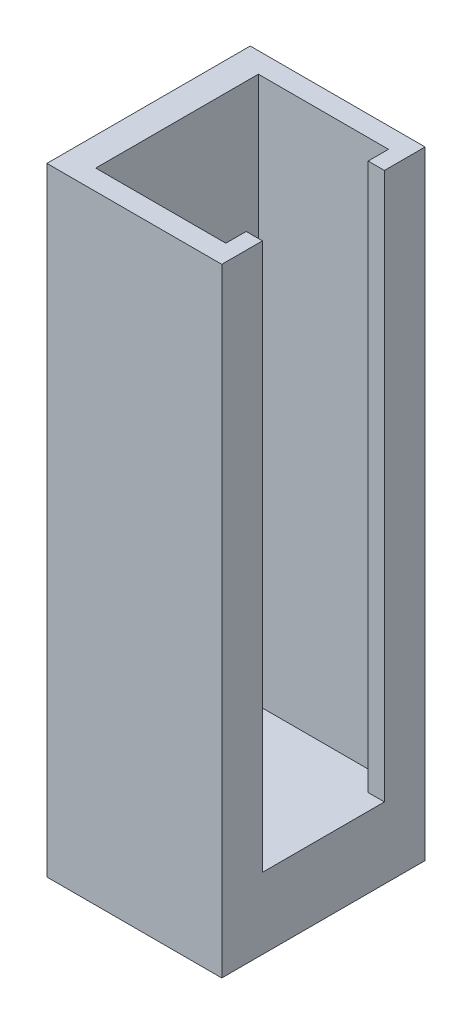
ISO-10303-21;
HEADER;
FILE_DESCRIPTION(('STEP AP214'),'2;1');
FILE_NAME('part.step','',(''),(''),'','','');
FILE_SCHEMA(('AUTOMOTIVE_DESIGN { 1 0 10303 214 1 1 1 1 }'));
ENDSEC;
DATA;
#1=APPLICATION_CONTEXT('core data for automotive mechanical design processes');
#2=APPLICATION_PROTOCOL_DEFINITION('international standard','automotive_design',2000,#1);
#3=PRODUCT_CONTEXT('',#1,'mechanical');
#4=PRODUCT('Part','Part','',(#3));
#5=PRODUCT_RELATED_PRODUCT_CATEGORY('part','',(#4));
#6=PRODUCT_DEFINITION_FORMATION('','',#4);
#7=PRODUCT_DEFINITION_CONTEXT('part definition',#1,'design');
#8=PRODUCT_DEFINITION('design','',#6,#7);
#9=PRODUCT_DEFINITION_SHAPE('','',#8);
#10=(LENGTH_UNIT() NAMED_UNIT(*) SI_UNIT(.MILLI.,.METRE.));
#11=(NAMED_UNIT(*) PLANE_ANGLE_UNIT() SI_UNIT($,.RADIAN.));
#12=(NAMED_UNIT(*) SI_UNIT($,.STERADIAN.) SOLID_ANGLE_UNIT());
#13=UNCERTAINTY_MEASURE_WITH_UNIT(LENGTH_MEASURE(1.E-05),#10,'distance_accuracy_value','');
#14=(GEOMETRIC_REPRESENTATION_CONTEXT(3) GLOBAL_UNCERTAINTY_ASSIGNED_CONTEXT((#13)) GLOBAL_UNIT_ASSIGNED_CONTEXT((#10,
#11,#12)) REPRESENTATION_CONTEXT('',''));
#15=CARTESIAN_POINT('',(0.,0.,0.));
#16=DIRECTION('',(0.,0.,1.));
#17=DIRECTION('',(1.,0.,0.));
#18=AXIS2_PLACEMENT_3D('',#15,#16,#17);
#19=CARTESIAN_POINT('',(-2.15,0.,2.5));
#20=DIRECTION('',(1.,0.,0.));
#21=DIRECTION('',(0.,0.,-1.));
#22=AXIS2_PLACEMENT_3D('',#19,#20,#21);
#23=PLANE('',#22);
#24=DIRECTION('',(0.,-1.,0.));
#25=VECTOR('',#24,1.);
#26=CARTESIAN_POINT('',(-2.15,0.,-2.5));
#27=LINE('',#26,#25);
#28=CARTESIAN_POINT('',(-2.15,15.2,-2.5));
#29=VERTEX_POINT('',#28);
#30=CARTESIAN_POINT('',(-2.15,0.,-2.5));
#31=VERTEX_POINT('',#30);
#32=EDGE_CURVE('E165',#29,#31,#27,.T.);
#33=ORIENTED_EDGE('',*,*,#32,.T.);
#34=DIRECTION('',(0.,0.,-1.));
#35=VECTOR('',#34,1.);
#36=CARTESIAN_POINT('',(-2.15,0.,2.5));
#37=LINE('',#36,#35);
#38=CARTESIAN_POINT('',(-2.15,0.,2.5));
#39=VERTEX_POINT('',#38);
#40=EDGE_CURVE('E11',#39,#31,#37,.T.);
#41=ORIENTED_EDGE('',*,*,#40,.F.);
#42=DIRECTION('',(0.,-1.,0.));
#43=VECTOR('',#42,1.);
#44=CARTESIAN_POINT('',(-2.15,0.,2.5));
#45=LINE('',#44,#43);
#46=CARTESIAN_POINT('',(-2.15,15.2,2.5));
#47=VERTEX_POINT('',#46);
#48=EDGE_CURVE('E159',#47,#39,#45,.T.);
#49=ORIENTED_EDGE('',*,*,#48,.F.);
#50=DIRECTION('',(0.,0.,-1.));
#51=VECTOR('',#50,1.);
#52=CARTESIAN_POINT('',(-2.15,15.2,2.5));
#53=LINE('',#52,#51);
#54=EDGE_CURVE('E155',#47,#29,#53,.T.);
#55=ORIENTED_EDGE('',*,*,#54,.T.);
#56=EDGE_LOOP('',(#33,#41,#49,#55));
#57=FACE_BOUND('',#56,.T.);
#58=ADVANCED_FACE('F34',(#57),#23,.F.);
#59=CARTESIAN_POINT('',(-2.15,0.,2.5));
#60=DIRECTION('',(0.,1.,0.));
#61=DIRECTION('',(-1.,0.,0.));
#62=AXIS2_PLACEMENT_3D('',#59,#60,#61);
#63=PLANE('',#62);
#64=DIRECTION('',(1.,0.,0.));
#65=VECTOR('',#64,1.);
#66=CARTESIAN_POINT('',(-2.15,0.,-2.5));
#67=LINE('',#66,#65);
#68=CARTESIAN_POINT('',(2.15,0.,-2.5));
#69=VERTEX_POINT('',#68);
#70=EDGE_CURVE('E163',#31,#69,#67,.T.);
#71=ORIENTED_EDGE('',*,*,#70,.T.);
#72=DIRECTION('',(0.,0.,-1.));
#73=VECTOR('',#72,1.);
#74=CARTESIAN_POINT('',(2.15,0.,2.5));
#75=LINE('',#74,#73);
#76=CARTESIAN_POINT('',(2.15,0.,2.5));
#77=VERTEX_POINT('',#76);
#78=EDGE_CURVE('E41',#77,#69,#75,.T.);
#79=ORIENTED_EDGE('',*,*,#78,.F.);
#80=DIRECTION('',(1.,0.,0.));
#81=VECTOR('',#80,1.);
#82=CARTESIAN_POINT('',(-2.15,0.,2.5));
#83=LINE('',#82,#81);
#84=EDGE_CURVE('E84',#39,#77,#83,.T.);
#85=ORIENTED_EDGE('',*,*,#84,.F.);
#86=ORIENTED_EDGE('',*,*,#40,.T.);
#87=EDGE_LOOP('',(#71,#79,#85,#86));
#88=FACE_BOUND('',#87,.T.);
#89=ADVANCED_FACE('F247',(#88),#63,.F.);
#90=CARTESIAN_POINT('',(2.15,0.,2.5));
#91=DIRECTION('',(-1.,0.,0.));
#92=DIRECTION('',(0.,0.,1.));
#93=AXIS2_PLACEMENT_3D('',#90,#91,#92);
#94=PLANE('',#93);
#95=DIRECTION('',(0.,0.,-1.));
#96=VECTOR('',#95,1.);
#97=CARTESIAN_POINT('',(2.15,15.2,2.5));
#98=LINE('',#97,#96);
#99=CARTESIAN_POINT('',(2.15,15.2,-1.5));
#100=VERTEX_POINT('',#99);
#101=CARTESIAN_POINT('',(2.15,15.2,-2.5));
#102=VERTEX_POINT('',#101);
#103=EDGE_CURVE('E152',#100,#102,#98,.T.);
#104=ORIENTED_EDGE('',*,*,#103,.F.);
#105=DIRECTION('',(0.,-1.,0.));
#106=VECTOR('',#105,1.);
#107=CARTESIAN_POINT('',(2.15,15.2,-1.5));
#108=LINE('',#107,#106);
#109=CARTESIAN_POINT('',(2.15,1.75,-1.5));
#110=VERTEX_POINT('',#109);
#111=EDGE_CURVE('E168',#100,#110,#108,.T.);
#112=ORIENTED_EDGE('',*,*,#111,.T.);
#113=DIRECTION('',(0.,0.,1.));
#114=VECTOR('',#113,1.);
#115=CARTESIAN_POINT('',(2.15,1.75,-1.5));
#116=LINE('',#115,#114);
#117=CARTESIAN_POINT('',(2.15,1.75,1.5));
#118=VERTEX_POINT('',#117);
#119=EDGE_CURVE('E147',#110,#118,#116,.T.);
#120=ORIENTED_EDGE('',*,*,#119,.T.);
#121=DIRECTION('',(0.,-1.,0.));
#122=VECTOR('',#121,1.);
#123=CARTESIAN_POINT('',(2.15,15.2,1.5));
#124=LINE('',#123,#122);
#125=CARTESIAN_POINT('',(2.15,15.2,1.5));
#126=VERTEX_POINT('',#125);
#127=EDGE_CURVE('E133',#126,#118,#124,.T.);
#128=ORIENTED_EDGE('',*,*,#127,.F.);
#129=CARTESIAN_POINT('',(2.15,15.2,2.5));
#130=VERTEX_POINT('',#129);
#131=EDGE_CURVE('E145',#130,#126,#98,.T.);
#132=ORIENTED_EDGE('',*,*,#131,.F.);
#133=DIRECTION('',(0.,1.,0.));
#134=VECTOR('',#133,1.);
#135=CARTESIAN_POINT('',(2.15,0.,2.5));
#136=LINE('',#135,#134);
#137=EDGE_CURVE('E170',#77,#130,#136,.T.);
#138=ORIENTED_EDGE('',*,*,#137,.F.);
#139=ORIENTED_EDGE('',*,*,#78,.T.);
#140=DIRECTION('',(0.,1.,0.));
#141=VECTOR('',#140,1.);
#142=CARTESIAN_POINT('',(2.15,0.,-2.5));
#143=LINE('',#142,#141);
#144=EDGE_CURVE('E160',#69,#102,#143,.T.);
#145=ORIENTED_EDGE('',*,*,#144,.T.);
#146=EDGE_LOOP('',(#104,#112,#120,#128,#132,#138,#139,#145));
#147=FACE_BOUND('',#146,.T.);
#148=ADVANCED_FACE('F143',(#147),#94,.F.);
#149=CARTESIAN_POINT('',(-2.15,15.2,2.5));
#150=DIRECTION('',(0.,-1.,0.));
#151=DIRECTION('',(0.,0.,-1.));
#152=AXIS2_PLACEMENT_3D('',#149,#150,#151);
#153=PLANE('',#152);
#154=DIRECTION('',(0.,0.,1.));
#155=VECTOR('',#154,1.);
#156=CARTESIAN_POINT('',(1.75,15.2,-2.));
#157=LINE('',#156,#155);
#158=CARTESIAN_POINT('',(1.75,15.2,-2.));
#159=VERTEX_POINT('',#158);
#160=CARTESIAN_POINT('',(1.75,15.2,-1.5));
#161=VERTEX_POINT('',#160);
#162=EDGE_CURVE('E208',#159,#161,#157,.T.);
#163=ORIENTED_EDGE('',*,*,#162,.T.);
#164=DIRECTION('',(1.,0.,0.));
#165=VECTOR('',#164,1.);
#166=CARTESIAN_POINT('',(1.75,15.2,-1.5));
#167=LINE('',#166,#165);
#168=EDGE_CURVE('E148',#161,#100,#167,.T.);
#169=ORIENTED_EDGE('',*,*,#168,.T.);
#170=ORIENTED_EDGE('',*,*,#103,.T.);
#171=DIRECTION('',(-1.,0.,0.));
#172=VECTOR('',#171,1.);
#173=CARTESIAN_POINT('',(-2.15,15.2,-2.5));
#174=LINE('',#173,#172);
#175=EDGE_CURVE('E77',#102,#29,#174,.T.);
#176=ORIENTED_EDGE('',*,*,#175,.T.);
#177=ORIENTED_EDGE('',*,*,#54,.F.);
#178=DIRECTION('',(-1.,0.,0.));
#179=VECTOR('',#178,1.);
#180=CARTESIAN_POINT('',(-2.15,15.2,2.5));
#181=LINE('',#180,#179);
#182=EDGE_CURVE('E57',#130,#47,#181,.T.);
#183=ORIENTED_EDGE('',*,*,#182,.F.);
#184=ORIENTED_EDGE('',*,*,#131,.T.);
#185=DIRECTION('',(-1.,0.,0.));
#186=VECTOR('',#185,1.);
#187=CARTESIAN_POINT('',(2.15,15.2,1.5));
#188=LINE('',#187,#186);
#189=CARTESIAN_POINT('',(1.75,15.2,1.5));
#190=VERTEX_POINT('',#189);
#191=EDGE_CURVE('E129',#126,#190,#188,.T.);
#192=ORIENTED_EDGE('',*,*,#191,.T.);
#193=DIRECTION('',(0.,0.,1.));
#194=VECTOR('',#193,1.);
#195=CARTESIAN_POINT('',(1.75,15.2,1.5));
#196=LINE('',#195,#194);
#197=CARTESIAN_POINT('',(1.75,15.2,2.));
#198=VERTEX_POINT('',#197);
#199=EDGE_CURVE('E48',#190,#198,#196,.T.);
#200=ORIENTED_EDGE('',*,*,#199,.T.);
#201=DIRECTION('',(-1.,0.,0.));
#202=VECTOR('',#201,1.);
#203=CARTESIAN_POINT('',(1.75,15.2,2.));
#204=LINE('',#203,#202);
#205=CARTESIAN_POINT('',(-1.45,15.2,2.));
#206=VERTEX_POINT('',#205);
#207=EDGE_CURVE('E216',#198,#206,#204,.T.);
#208=ORIENTED_EDGE('',*,*,#207,.T.);
#209=DIRECTION('',(0.,0.,-1.));
#210=VECTOR('',#209,1.);
#211=CARTESIAN_POINT('',(-1.45,15.2,2.));
#212=LINE('',#211,#210);
#213=CARTESIAN_POINT('',(-1.45,15.2,-2.));
#214=VERTEX_POINT('',#213);
#215=EDGE_CURVE('E213',#206,#214,#212,.T.);
#216=ORIENTED_EDGE('',*,*,#215,.T.);
#217=DIRECTION('',(1.,0.,0.));
#218=VECTOR('',#217,1.);
#219=CARTESIAN_POINT('',(-1.45,15.2,-2.));
#220=LINE('',#219,#218);
#221=EDGE_CURVE('E210',#214,#159,#220,.T.);
#222=ORIENTED_EDGE('',*,*,#221,.T.);
#223=EDGE_LOOP('',(#163,#169,#170,#176,#177,#183,#184,#192,#200,#208,#216,#222));
#224=FACE_BOUND('',#223,.T.);
#225=ADVANCED_FACE('F151',(#224),#153,.F.);
#226=CARTESIAN_POINT('',(0.,0.,2.5));
#227=DIRECTION('',(0.,0.,-1.));
#228=DIRECTION('',(-1.,0.,0.));
#229=AXIS2_PLACEMENT_3D('',#226,#227,#228);
#230=PLANE('',#229);
#231=ORIENTED_EDGE('',*,*,#48,.T.);
#232=ORIENTED_EDGE('',*,*,#84,.T.);
#233=ORIENTED_EDGE('',*,*,#137,.T.);
#234=ORIENTED_EDGE('',*,*,#182,.T.);
#235=EDGE_LOOP('',(#231,#232,#233,#234));
#236=FACE_BOUND('',#235,.T.);
#237=ADVANCED_FACE('F246',(#236),#230,.F.);
#238=CARTESIAN_POINT('',(0.,0.,-2.5));
#239=DIRECTION('',(0.,0.,-1.));
#240=DIRECTION('',(-1.,0.,0.));
#241=AXIS2_PLACEMENT_3D('',#238,#239,#240);
#242=PLANE('',#241);
#243=ORIENTED_EDGE('',*,*,#32,.F.);
#244=ORIENTED_EDGE('',*,*,#175,.F.);
#245=ORIENTED_EDGE('',*,*,#144,.F.);
#246=ORIENTED_EDGE('',*,*,#70,.F.);
#247=EDGE_LOOP('',(#243,#244,#245,#246));
#248=FACE_BOUND('',#247,.T.);
#249=ADVANCED_FACE('F242',(#248),#242,.T.);
#250=CARTESIAN_POINT('',(1.75,15.2,-1.5));
#251=DIRECTION('',(0.,0.,-1.));
#252=DIRECTION('',(-1.,0.,0.));
#253=AXIS2_PLACEMENT_3D('',#250,#251,#252);
#254=PLANE('',#253);
#255=DIRECTION('',(1.,0.,0.));
#256=VECTOR('',#255,1.);
#257=CARTESIAN_POINT('',(1.75,1.75,-1.5));
#258=LINE('',#257,#256);
#259=CARTESIAN_POINT('',(1.75,1.75,-1.5));
#260=VERTEX_POINT('',#259);
#261=EDGE_CURVE('E137',#260,#110,#258,.T.);
#262=ORIENTED_EDGE('',*,*,#261,.T.);
#263=ORIENTED_EDGE('',*,*,#111,.F.);
#264=ORIENTED_EDGE('',*,*,#168,.F.);
#265=DIRECTION('',(0.,-1.,0.));
#266=VECTOR('',#265,1.);
#267=CARTESIAN_POINT('',(1.75,15.2,-1.5));
#268=LINE('',#267,#266);
#269=EDGE_CURVE('E183',#161,#260,#268,.T.);
#270=ORIENTED_EDGE('',*,*,#269,.T.);
#271=EDGE_LOOP('',(#262,#263,#264,#270));
#272=FACE_BOUND('',#271,.T.);
#273=ADVANCED_FACE('F238',(#272),#254,.F.);
#274=CARTESIAN_POINT('',(1.75,15.2,-2.));
#275=DIRECTION('',(1.,0.,0.));
#276=DIRECTION('',(0.,0.,-1.));
#277=AXIS2_PLACEMENT_3D('',#274,#275,#276);
#278=PLANE('',#277);
#279=DIRECTION('',(0.,0.,1.));
#280=VECTOR('',#279,1.);
#281=CARTESIAN_POINT('',(1.75,1.75,-2.));
#282=LINE('',#281,#280);
#283=CARTESIAN_POINT('',(1.75,1.75,-2.));
#284=VERTEX_POINT('',#283);
#285=EDGE_CURVE('E188',#284,#260,#282,.T.);
#286=ORIENTED_EDGE('',*,*,#285,.T.);
#287=ORIENTED_EDGE('',*,*,#269,.F.);
#288=ORIENTED_EDGE('',*,*,#162,.F.);
#289=DIRECTION('',(0.,-1.,0.));
#290=VECTOR('',#289,1.);
#291=CARTESIAN_POINT('',(1.75,15.2,-2.));
#292=LINE('',#291,#290);
#293=EDGE_CURVE('E181',#159,#284,#292,.T.);
#294=ORIENTED_EDGE('',*,*,#293,.T.);
#295=EDGE_LOOP('',(#286,#287,#288,#294));
#296=FACE_BOUND('',#295,.T.);
#297=ADVANCED_FACE('F234',(#296),#278,.F.);
#298=CARTESIAN_POINT('',(-1.45,15.2,-2.));
#299=DIRECTION('',(0.,0.,-1.));
#300=DIRECTION('',(-1.,0.,0.));
#301=AXIS2_PLACEMENT_3D('',#298,#299,#300);
#302=PLANE('',#301);
#303=DIRECTION('',(1.,0.,0.));
#304=VECTOR('',#303,1.);
#305=CARTESIAN_POINT('',(-1.45,1.75,-2.));
#306=LINE('',#305,#304);
#307=CARTESIAN_POINT('',(-1.45,1.75,-2.));
#308=VERTEX_POINT('',#307);
#309=EDGE_CURVE('E191',#308,#284,#306,.T.);
#310=ORIENTED_EDGE('',*,*,#309,.T.);
#311=ORIENTED_EDGE('',*,*,#293,.F.);
#312=ORIENTED_EDGE('',*,*,#221,.F.);
#313=DIRECTION('',(0.,-1.,0.));
#314=VECTOR('',#313,1.);
#315=CARTESIAN_POINT('',(-1.45,15.2,-2.));
#316=LINE('',#315,#314);
#317=EDGE_CURVE('E179',#214,#308,#316,.T.);
#318=ORIENTED_EDGE('',*,*,#317,.T.);
#319=EDGE_LOOP('',(#310,#311,#312,#318));
#320=FACE_BOUND('',#319,.T.);
#321=ADVANCED_FACE('F230',(#320),#302,.F.);
#322=CARTESIAN_POINT('',(-1.45,15.2,2.));
#323=DIRECTION('',(-1.,0.,0.));
#324=DIRECTION('',(0.,-1.,0.));
#325=AXIS2_PLACEMENT_3D('',#322,#323,#324);
#326=PLANE('',#325);
#327=DIRECTION('',(0.,0.,-1.));
#328=VECTOR('',#327,1.);
#329=CARTESIAN_POINT('',(-1.45,1.75,2.));
#330=LINE('',#329,#328);
#331=CARTESIAN_POINT('',(-1.45,1.75,2.));
#332=VERTEX_POINT('',#331);
#333=EDGE_CURVE('E194',#332,#308,#330,.T.);
#334=ORIENTED_EDGE('',*,*,#333,.T.);
#335=ORIENTED_EDGE('',*,*,#317,.F.);
#336=ORIENTED_EDGE('',*,*,#215,.F.);
#337=DIRECTION('',(0.,-1.,0.));
#338=VECTOR('',#337,1.);
#339=CARTESIAN_POINT('',(-1.45,15.2,2.));
#340=LINE('',#339,#338);
#341=EDGE_CURVE('E177',#206,#332,#340,.T.);
#342=ORIENTED_EDGE('',*,*,#341,.T.);
#343=EDGE_LOOP('',(#334,#335,#336,#342));
#344=FACE_BOUND('',#343,.T.);
#345=ADVANCED_FACE('F226',(#344),#326,.F.);
#346=CARTESIAN_POINT('',(1.75,15.2,2.));
#347=DIRECTION('',(0.,0.,1.));
#348=DIRECTION('',(1.,0.,0.));
#349=AXIS2_PLACEMENT_3D('',#346,#347,#348);
#350=PLANE('',#349);
#351=DIRECTION('',(-1.,0.,0.));
#352=VECTOR('',#351,1.);
#353=CARTESIAN_POINT('',(1.75,1.75,2.));
#354=LINE('',#353,#352);
#355=CARTESIAN_POINT('',(1.75,1.75,2.));
#356=VERTEX_POINT('',#355);
#357=EDGE_CURVE('E197',#356,#332,#354,.T.);
#358=ORIENTED_EDGE('',*,*,#357,.T.);
#359=ORIENTED_EDGE('',*,*,#341,.F.);
#360=ORIENTED_EDGE('',*,*,#207,.F.);
#361=DIRECTION('',(0.,-1.,0.));
#362=VECTOR('',#361,1.);
#363=CARTESIAN_POINT('',(1.75,15.2,2.));
#364=LINE('',#363,#362);
#365=EDGE_CURVE('E175',#198,#356,#364,.T.);
#366=ORIENTED_EDGE('',*,*,#365,.T.);
#367=EDGE_LOOP('',(#358,#359,#360,#366));
#368=FACE_BOUND('',#367,.T.);
#369=ADVANCED_FACE('F222',(#368),#350,.F.);
#370=CARTESIAN_POINT('',(1.75,15.2,1.5));
#371=DIRECTION('',(1.,0.,0.));
#372=DIRECTION('',(0.,0.,-1.));
#373=AXIS2_PLACEMENT_3D('',#370,#371,#372);
#374=PLANE('',#373);
#375=DIRECTION('',(0.,0.,1.));
#376=VECTOR('',#375,1.);
#377=CARTESIAN_POINT('',(1.75,1.75,1.5));
#378=LINE('',#377,#376);
#379=CARTESIAN_POINT('',(1.75,1.75,1.5));
#380=VERTEX_POINT('',#379);
#381=EDGE_CURVE('E200',#380,#356,#378,.T.);
#382=ORIENTED_EDGE('',*,*,#381,.T.);
#383=ORIENTED_EDGE('',*,*,#365,.F.);
#384=ORIENTED_EDGE('',*,*,#199,.F.);
#385=DIRECTION('',(0.,-1.,0.));
#386=VECTOR('',#385,1.);
#387=CARTESIAN_POINT('',(1.75,15.2,1.5));
#388=LINE('',#387,#386);
#389=EDGE_CURVE('E135',#190,#380,#388,.T.);
#390=ORIENTED_EDGE('',*,*,#389,.T.);
#391=EDGE_LOOP('',(#382,#383,#384,#390));
#392=FACE_BOUND('',#391,.T.);
#393=ADVANCED_FACE('F264',(#392),#374,.F.);
#394=CARTESIAN_POINT('',(2.15,15.2,1.5));
#395=DIRECTION('',(0.,0.,1.));
#396=DIRECTION('',(1.,0.,0.));
#397=AXIS2_PLACEMENT_3D('',#394,#395,#396);
#398=PLANE('',#397);
#399=DIRECTION('',(-1.,0.,0.));
#400=VECTOR('',#399,1.);
#401=CARTESIAN_POINT('',(2.15,1.75,1.5));
#402=LINE('',#401,#400);
#403=EDGE_CURVE('E203',#118,#380,#402,.T.);
#404=ORIENTED_EDGE('',*,*,#403,.T.);
#405=ORIENTED_EDGE('',*,*,#389,.F.);
#406=ORIENTED_EDGE('',*,*,#191,.F.);
#407=ORIENTED_EDGE('',*,*,#127,.T.);
#408=EDGE_LOOP('',(#404,#405,#406,#407));
#409=FACE_BOUND('',#408,.T.);
#410=ADVANCED_FACE('F132',(#409),#398,.F.);
#411=CARTESIAN_POINT('',(0.,1.75,0.));
#412=DIRECTION('',(0.,-1.,0.));
#413=DIRECTION('',(1.,0.,0.));
#414=AXIS2_PLACEMENT_3D('',#411,#412,#413);
#415=PLANE('',#414);
#416=ORIENTED_EDGE('',*,*,#119,.F.);
#417=ORIENTED_EDGE('',*,*,#261,.F.);
#418=ORIENTED_EDGE('',*,*,#285,.F.);
#419=ORIENTED_EDGE('',*,*,#309,.F.);
#420=ORIENTED_EDGE('',*,*,#333,.F.);
#421=ORIENTED_EDGE('',*,*,#357,.F.);
#422=ORIENTED_EDGE('',*,*,#381,.F.);
#423=ORIENTED_EDGE('',*,*,#403,.F.);
#424=EDGE_LOOP('',(#416,#417,#418,#419,#420,#421,#422,#423));
#425=FACE_BOUND('',#424,.T.);
#426=ADVANCED_FACE('F263',(#425),#415,.F.);
#427=CLOSED_SHELL('',(#58,#89,#148,#225,#237,#249,#273,#297,#321,#345,#369,#393,#410,#426));
#428=MANIFOLD_SOLID_BREP('B2',#427);
#429=ADVANCED_BREP_SHAPE_REPRESENTATION('',(#18,#428),#14);
#430=SHAPE_DEFINITION_REPRESENTATION(#9,#429);
ENDSEC;
END-ISO-10303-21;
